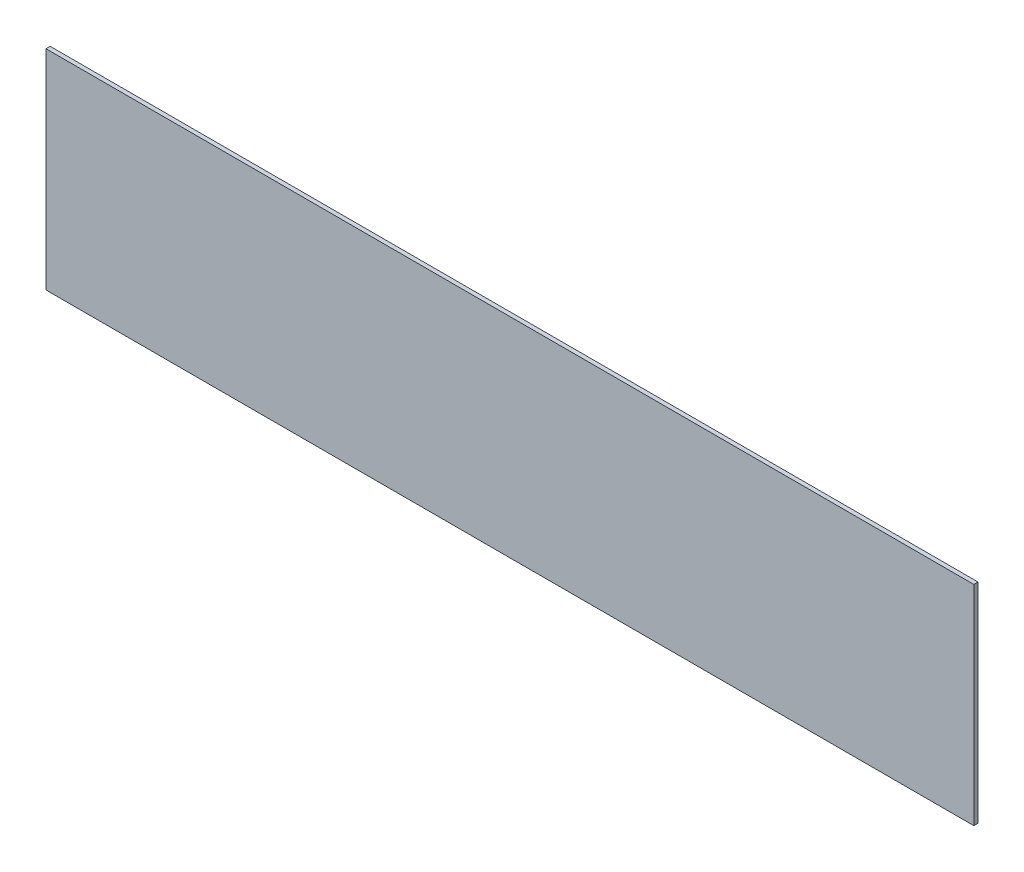
ISO-10303-21;
HEADER;
FILE_DESCRIPTION(('STEP AP214'),'2;1');
FILE_NAME('part.step','',(''),(''),'','','');
FILE_SCHEMA(('AUTOMOTIVE_DESIGN { 1 0 10303 214 1 1 1 1 }'));
ENDSEC;
DATA;
#1=APPLICATION_CONTEXT('core data for automotive mechanical design processes');
#2=APPLICATION_PROTOCOL_DEFINITION('international standard','automotive_design',2000,#1);
#3=PRODUCT_CONTEXT('',#1,'mechanical');
#4=PRODUCT('Part','Part','',(#3));
#5=PRODUCT_RELATED_PRODUCT_CATEGORY('part','',(#4));
#6=PRODUCT_DEFINITION_FORMATION('','',#4);
#7=PRODUCT_DEFINITION_CONTEXT('part definition',#1,'design');
#8=PRODUCT_DEFINITION('design','',#6,#7);
#9=PRODUCT_DEFINITION_SHAPE('','',#8);
#10=(LENGTH_UNIT() NAMED_UNIT(*) SI_UNIT(.MILLI.,.METRE.));
#11=(NAMED_UNIT(*) PLANE_ANGLE_UNIT() SI_UNIT($,.RADIAN.));
#12=(NAMED_UNIT(*) SI_UNIT($,.STERADIAN.) SOLID_ANGLE_UNIT());
#13=UNCERTAINTY_MEASURE_WITH_UNIT(LENGTH_MEASURE(1.E-05),#10,'distance_accuracy_value','');
#14=(GEOMETRIC_REPRESENTATION_CONTEXT(3) GLOBAL_UNCERTAINTY_ASSIGNED_CONTEXT((#13)) GLOBAL_UNIT_ASSIGNED_CONTEXT((#10,
#11,#12)) REPRESENTATION_CONTEXT('',''));
#15=CARTESIAN_POINT('',(0.,0.,0.));
#16=DIRECTION('',(0.,0.,1.));
#17=DIRECTION('',(1.,0.,0.));
#18=AXIS2_PLACEMENT_3D('',#15,#16,#17);
#19=CARTESIAN_POINT('',(-56.2268238717252,43.6378230847254,1.));
#20=DIRECTION('',(1.,0.,0.));
#21=DIRECTION('',(0.,0.,-1.));
#22=AXIS2_PLACEMENT_3D('',#19,#20,#21);
#23=PLANE('',#22);
#24=DIRECTION('',(0.,-1.,0.));
#25=VECTOR('',#24,1.);
#26=CARTESIAN_POINT('',(-56.2268238717252,43.6378230847254,0.));
#27=LINE('',#26,#25);
#28=CARTESIAN_POINT('',(-56.2268238717252,43.6378230847254,0.));
#29=VERTEX_POINT('',#28);
#30=CARTESIAN_POINT('',(-56.2268238717252,-6.36217691527463,0.));
#31=VERTEX_POINT('',#30);
#32=EDGE_CURVE('E96',#29,#31,#27,.T.);
#33=ORIENTED_EDGE('',*,*,#32,.T.);
#34=DIRECTION('',(0.,0.,-1.));
#35=VECTOR('',#34,1.);
#36=CARTESIAN_POINT('',(-56.2268238717252,-6.36217691527463,1.));
#37=LINE('',#36,#35);
#38=CARTESIAN_POINT('',(-56.2268238717252,-6.36217691527463,1.));
#39=VERTEX_POINT('',#38);
#40=EDGE_CURVE('E11',#39,#31,#37,.T.);
#41=ORIENTED_EDGE('',*,*,#40,.F.);
#42=DIRECTION('',(0.,-1.,0.));
#43=VECTOR('',#42,1.);
#44=CARTESIAN_POINT('',(-56.2268238717252,43.6378230847254,1.));
#45=LINE('',#44,#43);
#46=CARTESIAN_POINT('',(-56.2268238717252,43.6378230847254,1.));
#47=VERTEX_POINT('',#46);
#48=EDGE_CURVE('E84',#47,#39,#45,.T.);
#49=ORIENTED_EDGE('',*,*,#48,.F.);
#50=DIRECTION('',(0.,0.,-1.));
#51=VECTOR('',#50,1.);
#52=CARTESIAN_POINT('',(-56.2268238717252,43.6378230847254,1.));
#53=LINE('',#52,#51);
#54=EDGE_CURVE('E92',#47,#29,#53,.T.);
#55=ORIENTED_EDGE('',*,*,#54,.T.);
#56=EDGE_LOOP('',(#33,#41,#49,#55));
#57=FACE_BOUND('',#56,.T.);
#58=ADVANCED_FACE('F33',(#57),#23,.F.);
#59=CARTESIAN_POINT('',(-56.2268238717252,-6.36217691527463,1.));
#60=DIRECTION('',(0.,1.,0.));
#61=DIRECTION('',(0.,0.,1.));
#62=AXIS2_PLACEMENT_3D('',#59,#60,#61);
#63=PLANE('',#62);
#64=DIRECTION('',(1.,0.,0.));
#65=VECTOR('',#64,1.);
#66=CARTESIAN_POINT('',(-56.2268238717252,-6.36217691527463,0.));
#67=LINE('',#66,#65);
#68=CARTESIAN_POINT('',(165.773176128275,-6.36217691527463,0.));
#69=VERTEX_POINT('',#68);
#70=EDGE_CURVE('E88',#31,#69,#67,.T.);
#71=ORIENTED_EDGE('',*,*,#70,.T.);
#72=DIRECTION('',(0.,0.,-1.));
#73=VECTOR('',#72,1.);
#74=CARTESIAN_POINT('',(165.773176128275,-6.36217691527463,1.));
#75=LINE('',#74,#73);
#76=CARTESIAN_POINT('',(165.773176128275,-6.36217691527463,1.));
#77=VERTEX_POINT('',#76);
#78=EDGE_CURVE('E41',#77,#69,#75,.T.);
#79=ORIENTED_EDGE('',*,*,#78,.F.);
#80=DIRECTION('',(1.,0.,0.));
#81=VECTOR('',#80,1.);
#82=CARTESIAN_POINT('',(-56.2268238717252,-6.36217691527463,1.));
#83=LINE('',#82,#81);
#84=EDGE_CURVE('E79',#39,#77,#83,.T.);
#85=ORIENTED_EDGE('',*,*,#84,.F.);
#86=ORIENTED_EDGE('',*,*,#40,.T.);
#87=EDGE_LOOP('',(#71,#79,#85,#86));
#88=FACE_BOUND('',#87,.T.);
#89=ADVANCED_FACE('F87',(#88),#63,.F.);
#90=CARTESIAN_POINT('',(165.773176128275,43.6378230847254,1.));
#91=DIRECTION('',(-1.,0.,0.));
#92=DIRECTION('',(0.,0.,1.));
#93=AXIS2_PLACEMENT_3D('',#90,#91,#92);
#94=PLANE('',#93);
#95=DIRECTION('',(0.,1.,0.));
#96=VECTOR('',#95,1.);
#97=CARTESIAN_POINT('',(165.773176128275,43.6378230847254,0.));
#98=LINE('',#97,#96);
#99=CARTESIAN_POINT('',(165.773176128275,43.6378230847254,0.));
#100=VERTEX_POINT('',#99);
#101=EDGE_CURVE('E66',#69,#100,#98,.T.);
#102=ORIENTED_EDGE('',*,*,#101,.T.);
#103=DIRECTION('',(0.,0.,-1.));
#104=VECTOR('',#103,1.);
#105=CARTESIAN_POINT('',(165.773176128275,43.6378230847254,1.));
#106=LINE('',#105,#104);
#107=CARTESIAN_POINT('',(165.773176128275,43.6378230847254,1.));
#108=VERTEX_POINT('',#107);
#109=EDGE_CURVE('E89',#108,#100,#106,.T.);
#110=ORIENTED_EDGE('',*,*,#109,.F.);
#111=DIRECTION('',(0.,1.,0.));
#112=VECTOR('',#111,1.);
#113=CARTESIAN_POINT('',(165.773176128275,43.6378230847254,1.));
#114=LINE('',#113,#112);
#115=EDGE_CURVE('E82',#77,#108,#114,.T.);
#116=ORIENTED_EDGE('',*,*,#115,.F.);
#117=ORIENTED_EDGE('',*,*,#78,.T.);
#118=EDGE_LOOP('',(#102,#110,#116,#117));
#119=FACE_BOUND('',#118,.T.);
#120=ADVANCED_FACE('F90',(#119),#94,.F.);
#121=CARTESIAN_POINT('',(-56.2268238717252,43.6378230847254,1.));
#122=DIRECTION('',(0.,-1.,0.));
#123=DIRECTION('',(0.,0.,-1.));
#124=AXIS2_PLACEMENT_3D('',#121,#122,#123);
#125=PLANE('',#124);
#126=DIRECTION('',(-1.,0.,0.));
#127=VECTOR('',#126,1.);
#128=CARTESIAN_POINT('',(-56.2268238717252,43.6378230847254,0.));
#129=LINE('',#128,#127);
#130=EDGE_CURVE('E72',#100,#29,#129,.T.);
#131=ORIENTED_EDGE('',*,*,#130,.T.);
#132=ORIENTED_EDGE('',*,*,#54,.F.);
#133=DIRECTION('',(-1.,0.,0.));
#134=VECTOR('',#133,1.);
#135=CARTESIAN_POINT('',(-56.2268238717252,43.6378230847254,1.));
#136=LINE('',#135,#134);
#137=EDGE_CURVE('E49',#108,#47,#136,.T.);
#138=ORIENTED_EDGE('',*,*,#137,.F.);
#139=ORIENTED_EDGE('',*,*,#109,.T.);
#140=EDGE_LOOP('',(#131,#132,#138,#139));
#141=FACE_BOUND('',#140,.T.);
#142=ADVANCED_FACE('F103',(#141),#125,.F.);
#143=CARTESIAN_POINT('',(-56.2268238717252,-6.36217691527463,1.));
#144=DIRECTION('',(0.,0.,1.));
#145=DIRECTION('',(1.,0.,0.));
#146=AXIS2_PLACEMENT_3D('',#143,#144,#145);
#147=PLANE('',#146);
#148=ORIENTED_EDGE('',*,*,#48,.T.);
#149=ORIENTED_EDGE('',*,*,#84,.T.);
#150=ORIENTED_EDGE('',*,*,#115,.T.);
#151=ORIENTED_EDGE('',*,*,#137,.T.);
#152=EDGE_LOOP('',(#148,#149,#150,#151));
#153=FACE_BOUND('',#152,.T.);
#154=ADVANCED_FACE('F80',(#153),#147,.T.);
#155=CARTESIAN_POINT('',(-56.2268238717252,-6.36217691527463,0.));
#156=DIRECTION('',(0.,0.,1.));
#157=DIRECTION('',(1.,0.,0.));
#158=AXIS2_PLACEMENT_3D('',#155,#156,#157);
#159=PLANE('',#158);
#160=ORIENTED_EDGE('',*,*,#32,.F.);
#161=ORIENTED_EDGE('',*,*,#130,.F.);
#162=ORIENTED_EDGE('',*,*,#101,.F.);
#163=ORIENTED_EDGE('',*,*,#70,.F.);
#164=EDGE_LOOP('',(#160,#161,#162,#163));
#165=FACE_BOUND('',#164,.T.);
#166=ADVANCED_FACE('F106',(#165),#159,.F.);
#167=CLOSED_SHELL('',(#58,#89,#120,#142,#154,#166));
#168=MANIFOLD_SOLID_BREP('B2',#167);
#169=ADVANCED_BREP_SHAPE_REPRESENTATION('',(#18,#168),#14);
#170=SHAPE_DEFINITION_REPRESENTATION(#9,#169);
ENDSEC;
END-ISO-10303-21;
